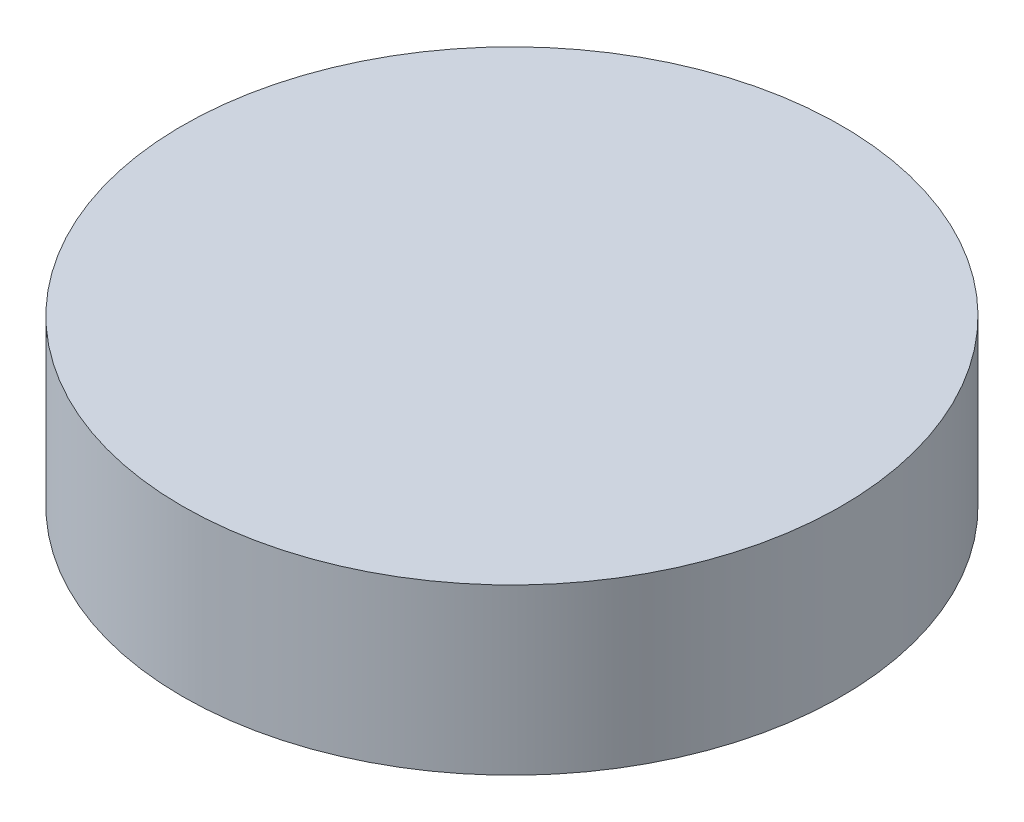
ISO-10303-21;
HEADER;
FILE_DESCRIPTION(('STEP AP214'),'2;1');
FILE_NAME('part.step','',(''),(''),'','','');
FILE_SCHEMA(('AUTOMOTIVE_DESIGN { 1 0 10303 214 1 1 1 1 }'));
ENDSEC;
DATA;
#1=APPLICATION_CONTEXT('core data for automotive mechanical design processes');
#2=APPLICATION_PROTOCOL_DEFINITION('international standard','automotive_design',2000,#1);
#3=PRODUCT_CONTEXT('',#1,'mechanical');
#4=PRODUCT('Part','Part','',(#3));
#5=PRODUCT_RELATED_PRODUCT_CATEGORY('part','',(#4));
#6=PRODUCT_DEFINITION_FORMATION('','',#4);
#7=PRODUCT_DEFINITION_CONTEXT('part definition',#1,'design');
#8=PRODUCT_DEFINITION('design','',#6,#7);
#9=PRODUCT_DEFINITION_SHAPE('','',#8);
#10=(LENGTH_UNIT() NAMED_UNIT(*) SI_UNIT(.MILLI.,.METRE.));
#11=(NAMED_UNIT(*) PLANE_ANGLE_UNIT() SI_UNIT($,.RADIAN.));
#12=(NAMED_UNIT(*) SI_UNIT($,.STERADIAN.) SOLID_ANGLE_UNIT());
#13=UNCERTAINTY_MEASURE_WITH_UNIT(LENGTH_MEASURE(1.E-05),#10,'distance_accuracy_value','');
#14=(GEOMETRIC_REPRESENTATION_CONTEXT(3) GLOBAL_UNCERTAINTY_ASSIGNED_CONTEXT((#13)) GLOBAL_UNIT_ASSIGNED_CONTEXT((#10,
#11,#12)) REPRESENTATION_CONTEXT('',''));
#15=CARTESIAN_POINT('',(0.,0.,0.));
#16=DIRECTION('',(0.,0.,1.));
#17=DIRECTION('',(1.,0.,0.));
#18=AXIS2_PLACEMENT_3D('',#15,#16,#17);
#19=CARTESIAN_POINT('',(0.,12.7,0.));
#20=DIRECTION('',(0.,-1.,0.));
#21=DIRECTION('',(0.,0.,-1.));
#22=AXIS2_PLACEMENT_3D('',#19,#20,#21);
#23=CYLINDRICAL_SURFACE('',#22,25.4);
#24=CARTESIAN_POINT('',(0.,12.7,0.));
#25=DIRECTION('',(0.,1.,0.));
#26=DIRECTION('',(0.,0.,1.));
#27=AXIS2_PLACEMENT_3D('',#24,#25,#26);
#28=CIRCLE('',#27,25.4);
#29=CARTESIAN_POINT('',(0.,12.7,25.4));
#30=VERTEX_POINT('',#29);
#31=EDGE_CURVE('E10',#30,#30,#28,.T.);
#32=ORIENTED_EDGE('',*,*,#31,.F.);
#33=EDGE_LOOP('',(#32));
#34=FACE_BOUND('',#33,.T.);
#35=CARTESIAN_POINT('',(0.,0.,0.));
#36=DIRECTION('',(0.,1.,0.));
#37=DIRECTION('',(0.,0.,1.));
#38=AXIS2_PLACEMENT_3D('',#35,#36,#37);
#39=CIRCLE('',#38,25.4);
#40=CARTESIAN_POINT('',(0.,0.,25.4));
#41=VERTEX_POINT('',#40);
#42=EDGE_CURVE('E36',#41,#41,#39,.T.);
#43=ORIENTED_EDGE('',*,*,#42,.T.);
#44=EDGE_LOOP('',(#43));
#45=FACE_BOUND('',#44,.T.);
#46=ADVANCED_FACE('F33',(#34,#45),#23,.T.);
#47=CARTESIAN_POINT('',(0.,12.7,0.));
#48=DIRECTION('',(0.,1.,0.));
#49=DIRECTION('',(0.,0.,1.));
#50=AXIS2_PLACEMENT_3D('',#47,#48,#49);
#51=PLANE('',#50);
#52=ORIENTED_EDGE('',*,*,#31,.T.);
#53=EDGE_LOOP('',(#52));
#54=FACE_BOUND('',#53,.T.);
#55=ADVANCED_FACE('F48',(#54),#51,.T.);
#56=CARTESIAN_POINT('',(0.,0.,0.));
#57=DIRECTION('',(0.,1.,0.));
#58=DIRECTION('',(0.,0.,1.));
#59=AXIS2_PLACEMENT_3D('',#56,#57,#58);
#60=PLANE('',#59);
#61=ORIENTED_EDGE('',*,*,#42,.F.);
#62=EDGE_LOOP('',(#61));
#63=FACE_BOUND('',#62,.T.);
#64=ADVANCED_FACE('F46',(#63),#60,.F.);
#65=CLOSED_SHELL('',(#46,#55,#64));
#66=MANIFOLD_SOLID_BREP('B2',#65);
#67=ADVANCED_BREP_SHAPE_REPRESENTATION('',(#18,#66),#14);
#68=SHAPE_DEFINITION_REPRESENTATION(#9,#67);
ENDSEC;
END-ISO-10303-21;
